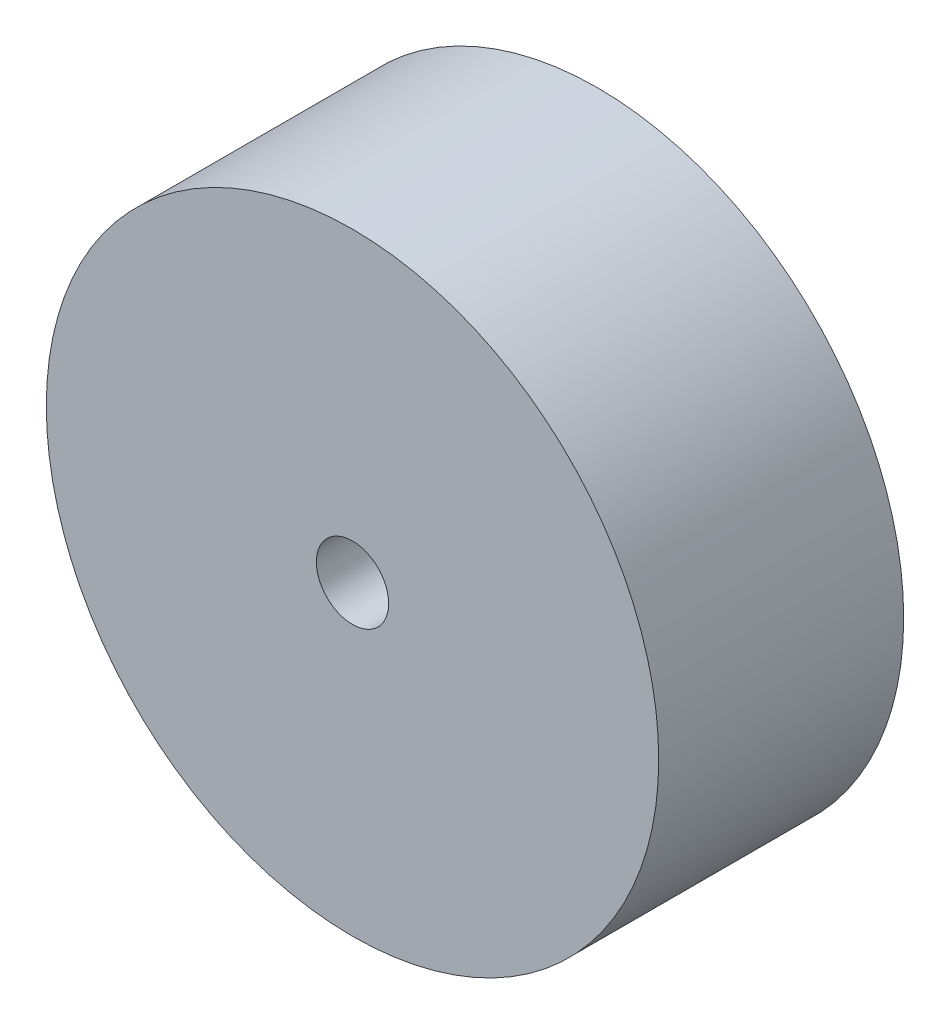
ISO-10303-21;
HEADER;
FILE_DESCRIPTION(('STEP AP214'),'2;1');
FILE_NAME('part.step','',(''),(''),'','','');
FILE_SCHEMA(('AUTOMOTIVE_DESIGN { 1 0 10303 214 1 1 1 1 }'));
ENDSEC;
DATA;
#1=APPLICATION_CONTEXT('core data for automotive mechanical design processes');
#2=APPLICATION_PROTOCOL_DEFINITION('international standard','automotive_design',2000,#1);
#3=PRODUCT_CONTEXT('',#1,'mechanical');
#4=PRODUCT('Part','Part','',(#3));
#5=PRODUCT_RELATED_PRODUCT_CATEGORY('part','',(#4));
#6=PRODUCT_DEFINITION_FORMATION('','',#4);
#7=PRODUCT_DEFINITION_CONTEXT('part definition',#1,'design');
#8=PRODUCT_DEFINITION('design','',#6,#7);
#9=PRODUCT_DEFINITION_SHAPE('','',#8);
#10=(LENGTH_UNIT() NAMED_UNIT(*) SI_UNIT(.MILLI.,.METRE.));
#11=(NAMED_UNIT(*) PLANE_ANGLE_UNIT() SI_UNIT($,.RADIAN.));
#12=(NAMED_UNIT(*) SI_UNIT($,.STERADIAN.) SOLID_ANGLE_UNIT());
#13=UNCERTAINTY_MEASURE_WITH_UNIT(LENGTH_MEASURE(1.E-05),#10,'distance_accuracy_value','');
#14=(GEOMETRIC_REPRESENTATION_CONTEXT(3) GLOBAL_UNCERTAINTY_ASSIGNED_CONTEXT((#13)) GLOBAL_UNIT_ASSIGNED_CONTEXT((#10,
#11,#12)) REPRESENTATION_CONTEXT('',''));
#15=CARTESIAN_POINT('',(0.,0.,0.));
#16=DIRECTION('',(0.,0.,1.));
#17=DIRECTION('',(1.,0.,0.));
#18=AXIS2_PLACEMENT_3D('',#15,#16,#17);
#19=CARTESIAN_POINT('',(0.,0.,20.32));
#20=DIRECTION('',(0.,0.,1.));
#21=DIRECTION('',(1.,0.,0.));
#22=AXIS2_PLACEMENT_3D('',#19,#20,#21);
#23=PLANE('',#22);
#24=CARTESIAN_POINT('',(0.,0.,20.32));
#25=DIRECTION('',(0.,0.,1.));
#26=DIRECTION('',(1.,0.,0.));
#27=AXIS2_PLACEMENT_3D('',#24,#25,#26);
#28=CIRCLE('',#27,25.4);
#29=CARTESIAN_POINT('',(25.4,0.,20.32));
#30=VERTEX_POINT('',#29);
#31=EDGE_CURVE('E10',#30,#30,#28,.T.);
#32=ORIENTED_EDGE('',*,*,#31,.T.);
#33=EDGE_LOOP('',(#32));
#34=FACE_BOUND('',#33,.T.);
#35=CARTESIAN_POINT('',(0.,0.,20.32));
#36=DIRECTION('',(0.,0.,1.));
#37=DIRECTION('',(1.,0.,0.));
#38=AXIS2_PLACEMENT_3D('',#35,#36,#37);
#39=CIRCLE('',#38,3.);
#40=CARTESIAN_POINT('',(3.,0.,20.32));
#41=VERTEX_POINT('',#40);
#42=EDGE_CURVE('E46',#41,#41,#39,.T.);
#43=ORIENTED_EDGE('',*,*,#42,.F.);
#44=EDGE_LOOP('',(#43));
#45=FACE_BOUND('',#44,.T.);
#46=ADVANCED_FACE('F35',(#34,#45),#23,.T.);
#47=CARTESIAN_POINT('',(0.,0.,0.));
#48=DIRECTION('',(0.,0.,1.));
#49=DIRECTION('',(1.,0.,0.));
#50=AXIS2_PLACEMENT_3D('',#47,#48,#49);
#51=PLANE('',#50);
#52=CARTESIAN_POINT('',(0.,0.,0.));
#53=DIRECTION('',(0.,0.,1.));
#54=DIRECTION('',(1.,0.,0.));
#55=AXIS2_PLACEMENT_3D('',#52,#53,#54);
#56=CIRCLE('',#55,25.4);
#57=CARTESIAN_POINT('',(25.4,0.,0.));
#58=VERTEX_POINT('',#57);
#59=EDGE_CURVE('E39',#58,#58,#56,.T.);
#60=ORIENTED_EDGE('',*,*,#59,.F.);
#61=EDGE_LOOP('',(#60));
#62=FACE_BOUND('',#61,.T.);
#63=CARTESIAN_POINT('',(0.,0.,0.));
#64=DIRECTION('',(0.,0.,1.));
#65=DIRECTION('',(1.,0.,0.));
#66=AXIS2_PLACEMENT_3D('',#63,#64,#65);
#67=CIRCLE('',#66,3.);
#68=CARTESIAN_POINT('',(3.,0.,0.));
#69=VERTEX_POINT('',#68);
#70=EDGE_CURVE('E48',#69,#69,#67,.T.);
#71=ORIENTED_EDGE('',*,*,#70,.T.);
#72=EDGE_LOOP('',(#71));
#73=FACE_BOUND('',#72,.T.);
#74=ADVANCED_FACE('F58',(#62,#73),#51,.F.);
#75=CARTESIAN_POINT('',(0.,0.,20.32));
#76=DIRECTION('',(0.,0.,-1.));
#77=DIRECTION('',(-1.,0.,0.));
#78=AXIS2_PLACEMENT_3D('',#75,#76,#77);
#79=CYLINDRICAL_SURFACE('',#78,25.4);
#80=ORIENTED_EDGE('',*,*,#31,.F.);
#81=EDGE_LOOP('',(#80));
#82=FACE_BOUND('',#81,.T.);
#83=ORIENTED_EDGE('',*,*,#59,.T.);
#84=EDGE_LOOP('',(#83));
#85=FACE_BOUND('',#84,.T.);
#86=ADVANCED_FACE('F37',(#82,#85),#79,.T.);
#87=CARTESIAN_POINT('',(0.,0.,20.32));
#88=DIRECTION('',(0.,0.,-1.));
#89=DIRECTION('',(-1.,0.,0.));
#90=AXIS2_PLACEMENT_3D('',#87,#88,#89);
#91=CYLINDRICAL_SURFACE('',#90,3.);
#92=ORIENTED_EDGE('',*,*,#42,.T.);
#93=EDGE_LOOP('',(#92));
#94=FACE_BOUND('',#93,.T.);
#95=ORIENTED_EDGE('',*,*,#70,.F.);
#96=EDGE_LOOP('',(#95));
#97=FACE_BOUND('',#96,.T.);
#98=ADVANCED_FACE('F54',(#94,#97),#91,.F.);
#99=CLOSED_SHELL('',(#46,#74,#86,#98));
#100=MANIFOLD_SOLID_BREP('B2',#99);
#101=ADVANCED_BREP_SHAPE_REPRESENTATION('',(#18,#100),#14);
#102=SHAPE_DEFINITION_REPRESENTATION(#9,#101);
ENDSEC;
END-ISO-10303-21;
